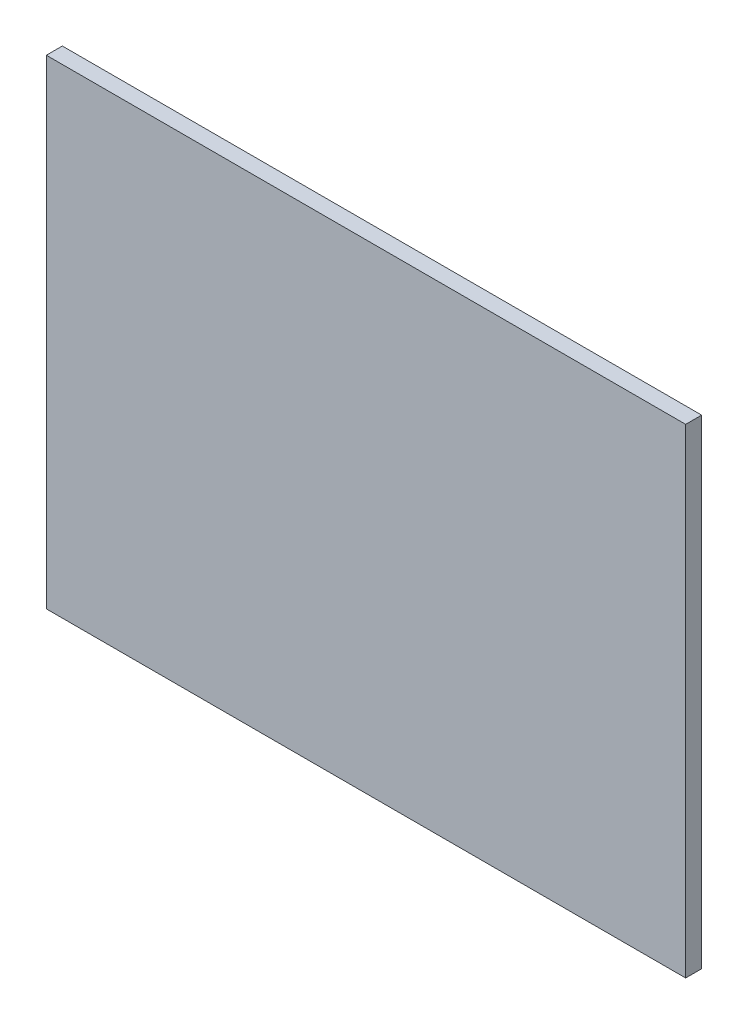
ISO-10303-21;
HEADER;
FILE_DESCRIPTION(('STEP AP214'),'2;1');
FILE_NAME('part.step','',(''),(''),'','','');
FILE_SCHEMA(('AUTOMOTIVE_DESIGN { 1 0 10303 214 1 1 1 1 }'));
ENDSEC;
DATA;
#1=APPLICATION_CONTEXT('core data for automotive mechanical design processes');
#2=APPLICATION_PROTOCOL_DEFINITION('international standard','automotive_design',2000,#1);
#3=PRODUCT_CONTEXT('',#1,'mechanical');
#4=PRODUCT('Part','Part','',(#3));
#5=PRODUCT_RELATED_PRODUCT_CATEGORY('part','',(#4));
#6=PRODUCT_DEFINITION_FORMATION('','',#4);
#7=PRODUCT_DEFINITION_CONTEXT('part definition',#1,'design');
#8=PRODUCT_DEFINITION('design','',#6,#7);
#9=PRODUCT_DEFINITION_SHAPE('','',#8);
#10=(LENGTH_UNIT() NAMED_UNIT(*) SI_UNIT(.MILLI.,.METRE.));
#11=(NAMED_UNIT(*) PLANE_ANGLE_UNIT() SI_UNIT($,.RADIAN.));
#12=(NAMED_UNIT(*) SI_UNIT($,.STERADIAN.) SOLID_ANGLE_UNIT());
#13=UNCERTAINTY_MEASURE_WITH_UNIT(LENGTH_MEASURE(1.E-05),#10,'distance_accuracy_value','');
#14=(GEOMETRIC_REPRESENTATION_CONTEXT(3) GLOBAL_UNCERTAINTY_ASSIGNED_CONTEXT((#13)) GLOBAL_UNIT_ASSIGNED_CONTEXT((#10,
#11,#12)) REPRESENTATION_CONTEXT('',''));
#15=CARTESIAN_POINT('',(0.,0.,0.));
#16=DIRECTION('',(0.,0.,1.));
#17=DIRECTION('',(1.,0.,0.));
#18=AXIS2_PLACEMENT_3D('',#15,#16,#17);
#19=CARTESIAN_POINT('',(0.,0.,0.25));
#20=DIRECTION('',(0.,0.,-1.));
#21=DIRECTION('',(-1.,0.,0.));
#22=AXIS2_PLACEMENT_3D('',#19,#20,#21);
#23=PLANE('',#22);
#24=DIRECTION('',(-1.,0.,0.));
#25=VECTOR('',#24,1.);
#26=CARTESIAN_POINT('',(-0.15,-0.15,0.25));
#27=LINE('',#26,#25);
#28=CARTESIAN_POINT('',(0.2,-0.15,0.25));
#29=VERTEX_POINT('',#28);
#30=CARTESIAN_POINT('',(-0.2,-0.15,0.25));
#31=VERTEX_POINT('',#30);
#32=EDGE_CURVE('E11',#29,#31,#27,.T.);
#33=ORIENTED_EDGE('',*,*,#32,.T.);
#34=DIRECTION('',(0.,1.,0.));
#35=VECTOR('',#34,1.);
#36=CARTESIAN_POINT('',(-0.2,0.184006542055292,0.25));
#37=LINE('',#36,#35);
#38=CARTESIAN_POINT('',(-0.2,0.15,0.25));
#39=VERTEX_POINT('',#38);
#40=EDGE_CURVE('E24',#31,#39,#37,.T.);
#41=ORIENTED_EDGE('',*,*,#40,.T.);
#42=DIRECTION('',(1.,0.,0.));
#43=VECTOR('',#42,1.);
#44=CARTESIAN_POINT('',(0.15,0.15,0.25));
#45=LINE('',#44,#43);
#46=CARTESIAN_POINT('',(0.2,0.15,0.25));
#47=VERTEX_POINT('',#46);
#48=EDGE_CURVE('E88',#39,#47,#45,.T.);
#49=ORIENTED_EDGE('',*,*,#48,.T.);
#50=DIRECTION('',(0.,-1.,0.));
#51=VECTOR('',#50,1.);
#52=CARTESIAN_POINT('',(0.2,-0.184006542055292,0.25));
#53=LINE('',#52,#51);
#54=EDGE_CURVE('E60',#47,#29,#53,.T.);
#55=ORIENTED_EDGE('',*,*,#54,.T.);
#56=EDGE_LOOP('',(#33,#41,#49,#55));
#57=FACE_BOUND('',#56,.T.);
#58=ADVANCED_FACE('F17',(#57),#23,.T.);
#59=CARTESIAN_POINT('',(-0.2,-0.184006542055292,0.26));
#60=DIRECTION('',(-1.,0.,0.));
#61=DIRECTION('',(0.,1.,0.));
#62=AXIS2_PLACEMENT_3D('',#59,#60,#61);
#63=PLANE('',#62);
#64=DIRECTION('',(0.,0.,1.));
#65=VECTOR('',#64,1.);
#66=CARTESIAN_POINT('',(-0.2,-0.15,0.13));
#67=LINE('',#66,#65);
#68=CARTESIAN_POINT('',(-0.2,-0.15,0.26));
#69=VERTEX_POINT('',#68);
#70=EDGE_CURVE('E85',#31,#69,#67,.T.);
#71=ORIENTED_EDGE('',*,*,#70,.T.);
#72=DIRECTION('',(0.,1.,0.));
#73=VECTOR('',#72,1.);
#74=CARTESIAN_POINT('',(-0.2,-0.0920032710276462,0.26));
#75=LINE('',#74,#73);
#76=CARTESIAN_POINT('',(-0.2,0.15,0.26));
#77=VERTEX_POINT('',#76);
#78=EDGE_CURVE('E83',#69,#77,#75,.T.);
#79=ORIENTED_EDGE('',*,*,#78,.T.);
#80=DIRECTION('',(0.,0.,-1.));
#81=VECTOR('',#80,1.);
#82=CARTESIAN_POINT('',(-0.2,0.15,0.13));
#83=LINE('',#82,#81);
#84=EDGE_CURVE('E77',#77,#39,#83,.T.);
#85=ORIENTED_EDGE('',*,*,#84,.T.);
#86=ORIENTED_EDGE('',*,*,#40,.F.);
#87=EDGE_LOOP('',(#71,#79,#85,#86));
#88=FACE_BOUND('',#87,.T.);
#89=ADVANCED_FACE('F90',(#88),#63,.T.);
#90=CARTESIAN_POINT('',(0.2,0.184006542055292,0.26));
#91=DIRECTION('',(1.,0.,0.));
#92=DIRECTION('',(0.,-1.,0.));
#93=AXIS2_PLACEMENT_3D('',#90,#91,#92);
#94=PLANE('',#93);
#95=DIRECTION('',(0.,0.,-1.));
#96=VECTOR('',#95,1.);
#97=CARTESIAN_POINT('',(0.2,-0.15,0.13));
#98=LINE('',#97,#96);
#99=CARTESIAN_POINT('',(0.2,-0.15,0.26));
#100=VERTEX_POINT('',#99);
#101=EDGE_CURVE('E64',#100,#29,#98,.T.);
#102=ORIENTED_EDGE('',*,*,#101,.T.);
#103=ORIENTED_EDGE('',*,*,#54,.F.);
#104=DIRECTION('',(0.,0.,1.));
#105=VECTOR('',#104,1.);
#106=CARTESIAN_POINT('',(0.2,0.15,0.13));
#107=LINE('',#106,#105);
#108=CARTESIAN_POINT('',(0.2,0.15,0.26));
#109=VERTEX_POINT('',#108);
#110=EDGE_CURVE('E54',#47,#109,#107,.T.);
#111=ORIENTED_EDGE('',*,*,#110,.T.);
#112=DIRECTION('',(0.,-1.,0.));
#113=VECTOR('',#112,1.);
#114=CARTESIAN_POINT('',(0.2,0.0920032710276462,0.26));
#115=LINE('',#114,#113);
#116=EDGE_CURVE('E58',#109,#100,#115,.T.);
#117=ORIENTED_EDGE('',*,*,#116,.T.);
#118=EDGE_LOOP('',(#102,#103,#111,#117));
#119=FACE_BOUND('',#118,.T.);
#120=ADVANCED_FACE('F57',(#119),#94,.T.);
#121=CARTESIAN_POINT('',(0.3,0.15,0.));
#122=DIRECTION('',(0.,1.,0.));
#123=DIRECTION('',(-1.,0.,0.));
#124=AXIS2_PLACEMENT_3D('',#121,#122,#123);
#125=PLANE('',#124);
#126=ORIENTED_EDGE('',*,*,#110,.F.);
#127=ORIENTED_EDGE('',*,*,#48,.F.);
#128=ORIENTED_EDGE('',*,*,#84,.F.);
#129=DIRECTION('',(-1.,0.,0.));
#130=VECTOR('',#129,1.);
#131=CARTESIAN_POINT('',(0.3,0.15,0.26));
#132=LINE('',#131,#130);
#133=EDGE_CURVE('E70',#109,#77,#132,.T.);
#134=ORIENTED_EDGE('',*,*,#133,.F.);
#135=EDGE_LOOP('',(#126,#127,#128,#134));
#136=FACE_BOUND('',#135,.T.);
#137=ADVANCED_FACE('F75',(#136),#125,.T.);
#138=CARTESIAN_POINT('',(0.,0.,0.26));
#139=DIRECTION('',(0.,0.,1.));
#140=DIRECTION('',(1.,0.,0.));
#141=AXIS2_PLACEMENT_3D('',#138,#139,#140);
#142=PLANE('',#141);
#143=ORIENTED_EDGE('',*,*,#116,.F.);
#144=ORIENTED_EDGE('',*,*,#133,.T.);
#145=ORIENTED_EDGE('',*,*,#78,.F.);
#146=DIRECTION('',(1.,0.,0.));
#147=VECTOR('',#146,1.);
#148=CARTESIAN_POINT('',(-0.3,-0.15,0.26));
#149=LINE('',#148,#147);
#150=EDGE_CURVE('E72',#69,#100,#149,.T.);
#151=ORIENTED_EDGE('',*,*,#150,.T.);
#152=EDGE_LOOP('',(#143,#144,#145,#151));
#153=FACE_BOUND('',#152,.T.);
#154=ADVANCED_FACE('F68',(#153),#142,.T.);
#155=CARTESIAN_POINT('',(-0.3,-0.15,0.));
#156=DIRECTION('',(0.,-1.,0.));
#157=DIRECTION('',(1.,0.,0.));
#158=AXIS2_PLACEMENT_3D('',#155,#156,#157);
#159=PLANE('',#158);
#160=ORIENTED_EDGE('',*,*,#101,.F.);
#161=ORIENTED_EDGE('',*,*,#150,.F.);
#162=ORIENTED_EDGE('',*,*,#70,.F.);
#163=ORIENTED_EDGE('',*,*,#32,.F.);
#164=EDGE_LOOP('',(#160,#161,#162,#163));
#165=FACE_BOUND('',#164,.T.);
#166=ADVANCED_FACE('F91',(#165),#159,.T.);
#167=CLOSED_SHELL('',(#58,#89,#120,#137,#154,#166));
#168=MANIFOLD_SOLID_BREP('B1',#167);
#169=ADVANCED_BREP_SHAPE_REPRESENTATION('',(#18,#168),#14);
#170=SHAPE_DEFINITION_REPRESENTATION(#9,#169);
ENDSEC;
END-ISO-10303-21;
